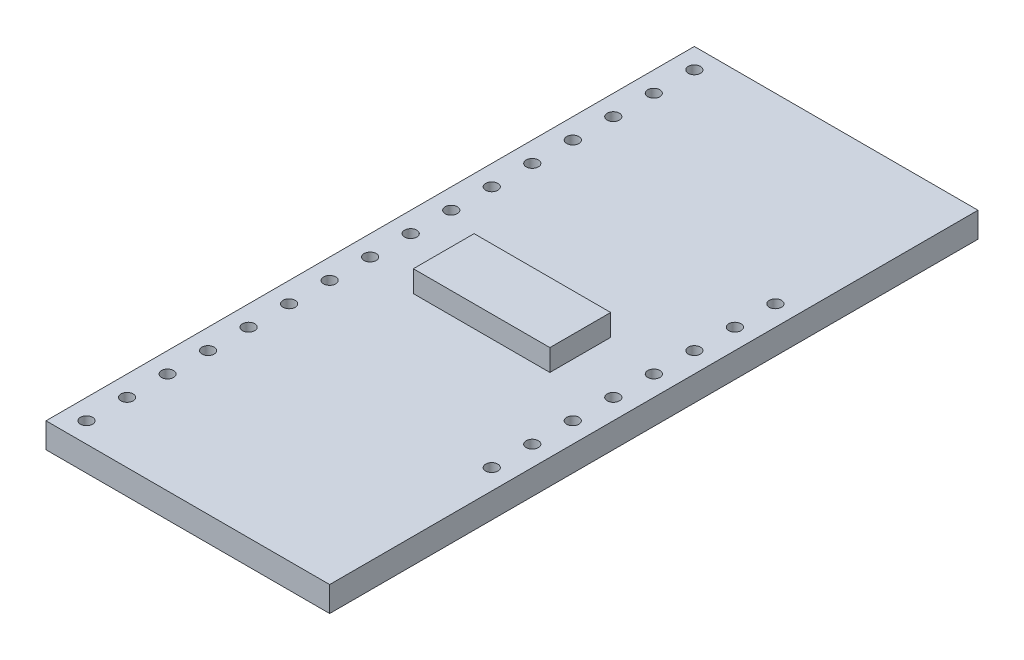
ISO-10303-21;
HEADER;
FILE_DESCRIPTION(('STEP AP214'),'2;1');
FILE_NAME('part.step','',(''),(''),'','','');
FILE_SCHEMA(('AUTOMOTIVE_DESIGN { 1 0 10303 214 1 1 1 1 }'));
ENDSEC;
DATA;
#1=APPLICATION_CONTEXT('core data for automotive mechanical design processes');
#2=APPLICATION_PROTOCOL_DEFINITION('international standard','automotive_design',2000,#1);
#3=PRODUCT_CONTEXT('',#1,'mechanical');
#4=PRODUCT('Part','Part','',(#3));
#5=PRODUCT_RELATED_PRODUCT_CATEGORY('part','',(#4));
#6=PRODUCT_DEFINITION_FORMATION('','',#4);
#7=PRODUCT_DEFINITION_CONTEXT('part definition',#1,'design');
#8=PRODUCT_DEFINITION('design','',#6,#7);
#9=PRODUCT_DEFINITION_SHAPE('','',#8);
#10=(LENGTH_UNIT() NAMED_UNIT(*) SI_UNIT(.MILLI.,.METRE.));
#11=(NAMED_UNIT(*) PLANE_ANGLE_UNIT() SI_UNIT($,.RADIAN.));
#12=(NAMED_UNIT(*) SI_UNIT($,.STERADIAN.) SOLID_ANGLE_UNIT());
#13=UNCERTAINTY_MEASURE_WITH_UNIT(LENGTH_MEASURE(1.E-05),#10,'distance_accuracy_value','');
#14=(GEOMETRIC_REPRESENTATION_CONTEXT(3) GLOBAL_UNCERTAINTY_ASSIGNED_CONTEXT((#13)) GLOBAL_UNIT_ASSIGNED_CONTEXT((#10,
#11,#12)) REPRESENTATION_CONTEXT('',''));
#15=CARTESIAN_POINT('',(0.,0.,0.));
#16=DIRECTION('',(0.,0.,1.));
#17=DIRECTION('',(1.,0.,0.));
#18=AXIS2_PLACEMENT_3D('',#15,#16,#17);
#19=CARTESIAN_POINT('',(0.,1.5748,0.));
#20=DIRECTION('',(0.,-1.,0.));
#21=DIRECTION('',(0.,0.,-1.));
#22=AXIS2_PLACEMENT_3D('',#19,#20,#21);
#23=PLANE('',#22);
#24=CARTESIAN_POINT('',(16.51,1.5748,-29.21));
#25=DIRECTION('',(0.,1.,0.));
#26=DIRECTION('',(0.,0.,1.));
#27=AXIS2_PLACEMENT_3D('',#24,#25,#26);
#28=CIRCLE('',#27,0.380999999999998);
#29=CARTESIAN_POINT('',(16.51,1.5748,-28.829));
#30=VERTEX_POINT('',#29);
#31=EDGE_CURVE('E11',#30,#30,#28,.T.);
#32=ORIENTED_EDGE('',*,*,#31,.F.);
#33=EDGE_LOOP('',(#32));
#34=FACE_BOUND('',#33,.T.);
#35=CARTESIAN_POINT('',(16.51,1.5748,-26.67));
#36=DIRECTION('',(0.,1.,0.));
#37=DIRECTION('',(0.,0.,1.));
#38=AXIS2_PLACEMENT_3D('',#35,#36,#37);
#39=CIRCLE('',#38,0.380999999999998);
#40=CARTESIAN_POINT('',(16.51,1.5748,-26.289));
#41=VERTEX_POINT('',#40);
#42=EDGE_CURVE('E293',#41,#41,#39,.T.);
#43=ORIENTED_EDGE('',*,*,#42,.F.);
#44=EDGE_LOOP('',(#43));
#45=FACE_BOUND('',#44,.T.);
#46=CARTESIAN_POINT('',(16.51,1.5748,-24.13));
#47=DIRECTION('',(0.,1.,0.));
#48=DIRECTION('',(0.,0.,1.));
#49=AXIS2_PLACEMENT_3D('',#46,#47,#48);
#50=CIRCLE('',#49,0.380999999999998);
#51=CARTESIAN_POINT('',(16.51,1.5748,-23.749));
#52=VERTEX_POINT('',#51);
#53=EDGE_CURVE('E287',#52,#52,#50,.T.);
#54=ORIENTED_EDGE('',*,*,#53,.F.);
#55=EDGE_LOOP('',(#54));
#56=FACE_BOUND('',#55,.T.);
#57=CARTESIAN_POINT('',(16.51,1.5748,-21.59));
#58=DIRECTION('',(0.,1.,0.));
#59=DIRECTION('',(0.,0.,1.));
#60=AXIS2_PLACEMENT_3D('',#57,#58,#59);
#61=CIRCLE('',#60,0.380999999999998);
#62=CARTESIAN_POINT('',(16.51,1.5748,-21.209));
#63=VERTEX_POINT('',#62);
#64=EDGE_CURVE('E281',#63,#63,#61,.T.);
#65=ORIENTED_EDGE('',*,*,#64,.F.);
#66=EDGE_LOOP('',(#65));
#67=FACE_BOUND('',#66,.T.);
#68=CARTESIAN_POINT('',(16.51,1.5748,-19.05));
#69=DIRECTION('',(0.,1.,0.));
#70=DIRECTION('',(0.,0.,1.));
#71=AXIS2_PLACEMENT_3D('',#68,#69,#70);
#72=CIRCLE('',#71,0.380999999999998);
#73=CARTESIAN_POINT('',(16.51,1.5748,-18.669));
#74=VERTEX_POINT('',#73);
#75=EDGE_CURVE('E275',#74,#74,#72,.T.);
#76=ORIENTED_EDGE('',*,*,#75,.F.);
#77=EDGE_LOOP('',(#76));
#78=FACE_BOUND('',#77,.T.);
#79=CARTESIAN_POINT('',(16.51,1.5748,-16.51));
#80=DIRECTION('',(0.,1.,0.));
#81=DIRECTION('',(0.,0.,1.));
#82=AXIS2_PLACEMENT_3D('',#79,#80,#81);
#83=CIRCLE('',#82,0.380999999999998);
#84=CARTESIAN_POINT('',(16.51,1.5748,-16.129));
#85=VERTEX_POINT('',#84);
#86=EDGE_CURVE('E269',#85,#85,#83,.T.);
#87=ORIENTED_EDGE('',*,*,#86,.F.);
#88=EDGE_LOOP('',(#87));
#89=FACE_BOUND('',#88,.T.);
#90=CARTESIAN_POINT('',(1.27,1.5748,-39.37));
#91=DIRECTION('',(0.,1.,0.));
#92=DIRECTION('',(0.,0.,1.));
#93=AXIS2_PLACEMENT_3D('',#90,#91,#92);
#94=CIRCLE('',#93,0.381);
#95=CARTESIAN_POINT('',(1.27,1.5748,-38.989));
#96=VERTEX_POINT('',#95);
#97=EDGE_CURVE('E263',#96,#96,#94,.T.);
#98=ORIENTED_EDGE('',*,*,#97,.F.);
#99=EDGE_LOOP('',(#98));
#100=FACE_BOUND('',#99,.T.);
#101=CARTESIAN_POINT('',(1.27,1.5748,-36.83));
#102=DIRECTION('',(0.,1.,0.));
#103=DIRECTION('',(0.,0.,1.));
#104=AXIS2_PLACEMENT_3D('',#101,#102,#103);
#105=CIRCLE('',#104,0.381);
#106=CARTESIAN_POINT('',(1.27,1.5748,-36.449));
#107=VERTEX_POINT('',#106);
#108=EDGE_CURVE('E257',#107,#107,#105,.T.);
#109=ORIENTED_EDGE('',*,*,#108,.F.);
#110=EDGE_LOOP('',(#109));
#111=FACE_BOUND('',#110,.T.);
#112=CARTESIAN_POINT('',(1.27,1.5748,-34.29));
#113=DIRECTION('',(0.,1.,0.));
#114=DIRECTION('',(0.,0.,1.));
#115=AXIS2_PLACEMENT_3D('',#112,#113,#114);
#116=CIRCLE('',#115,0.381);
#117=CARTESIAN_POINT('',(1.27,1.5748,-33.909));
#118=VERTEX_POINT('',#117);
#119=EDGE_CURVE('E251',#118,#118,#116,.T.);
#120=ORIENTED_EDGE('',*,*,#119,.F.);
#121=EDGE_LOOP('',(#120));
#122=FACE_BOUND('',#121,.T.);
#123=CARTESIAN_POINT('',(1.27,1.5748,-31.75));
#124=DIRECTION('',(0.,1.,0.));
#125=DIRECTION('',(0.,0.,1.));
#126=AXIS2_PLACEMENT_3D('',#123,#124,#125);
#127=CIRCLE('',#126,0.381);
#128=CARTESIAN_POINT('',(1.27,1.5748,-31.369));
#129=VERTEX_POINT('',#128);
#130=EDGE_CURVE('E245',#129,#129,#127,.T.);
#131=ORIENTED_EDGE('',*,*,#130,.F.);
#132=EDGE_LOOP('',(#131));
#133=FACE_BOUND('',#132,.T.);
#134=CARTESIAN_POINT('',(1.27,1.5748,-29.21));
#135=DIRECTION('',(0.,1.,0.));
#136=DIRECTION('',(0.,0.,1.));
#137=AXIS2_PLACEMENT_3D('',#134,#135,#136);
#138=CIRCLE('',#137,0.381);
#139=CARTESIAN_POINT('',(1.27,1.5748,-28.829));
#140=VERTEX_POINT('',#139);
#141=EDGE_CURVE('E239',#140,#140,#138,.T.);
#142=ORIENTED_EDGE('',*,*,#141,.F.);
#143=EDGE_LOOP('',(#142));
#144=FACE_BOUND('',#143,.T.);
#145=CARTESIAN_POINT('',(1.27,1.5748,-26.67));
#146=DIRECTION('',(0.,1.,0.));
#147=DIRECTION('',(0.,0.,1.));
#148=AXIS2_PLACEMENT_3D('',#145,#146,#147);
#149=CIRCLE('',#148,0.381);
#150=CARTESIAN_POINT('',(1.27,1.5748,-26.289));
#151=VERTEX_POINT('',#150);
#152=EDGE_CURVE('E233',#151,#151,#149,.T.);
#153=ORIENTED_EDGE('',*,*,#152,.F.);
#154=EDGE_LOOP('',(#153));
#155=FACE_BOUND('',#154,.T.);
#156=CARTESIAN_POINT('',(1.27,1.5748,-24.13));
#157=DIRECTION('',(0.,1.,0.));
#158=DIRECTION('',(0.,0.,1.));
#159=AXIS2_PLACEMENT_3D('',#156,#157,#158);
#160=CIRCLE('',#159,0.381);
#161=CARTESIAN_POINT('',(1.27,1.5748,-23.749));
#162=VERTEX_POINT('',#161);
#163=EDGE_CURVE('E227',#162,#162,#160,.T.);
#164=ORIENTED_EDGE('',*,*,#163,.F.);
#165=EDGE_LOOP('',(#164));
#166=FACE_BOUND('',#165,.T.);
#167=CARTESIAN_POINT('',(1.27,1.5748,-21.59));
#168=DIRECTION('',(0.,1.,0.));
#169=DIRECTION('',(0.,0.,1.));
#170=AXIS2_PLACEMENT_3D('',#167,#168,#169);
#171=CIRCLE('',#170,0.381);
#172=CARTESIAN_POINT('',(1.27,1.5748,-21.209));
#173=VERTEX_POINT('',#172);
#174=EDGE_CURVE('E221',#173,#173,#171,.T.);
#175=ORIENTED_EDGE('',*,*,#174,.F.);
#176=EDGE_LOOP('',(#175));
#177=FACE_BOUND('',#176,.T.);
#178=CARTESIAN_POINT('',(1.27,1.5748,-19.05));
#179=DIRECTION('',(0.,1.,0.));
#180=DIRECTION('',(0.,0.,1.));
#181=AXIS2_PLACEMENT_3D('',#178,#179,#180);
#182=CIRCLE('',#181,0.381);
#183=CARTESIAN_POINT('',(1.27,1.5748,-18.669));
#184=VERTEX_POINT('',#183);
#185=EDGE_CURVE('E215',#184,#184,#182,.T.);
#186=ORIENTED_EDGE('',*,*,#185,.F.);
#187=EDGE_LOOP('',(#186));
#188=FACE_BOUND('',#187,.T.);
#189=CARTESIAN_POINT('',(1.27,1.5748,-16.51));
#190=DIRECTION('',(0.,1.,0.));
#191=DIRECTION('',(0.,0.,1.));
#192=AXIS2_PLACEMENT_3D('',#189,#190,#191);
#193=CIRCLE('',#192,0.381);
#194=CARTESIAN_POINT('',(1.27,1.5748,-16.129));
#195=VERTEX_POINT('',#194);
#196=EDGE_CURVE('E209',#195,#195,#193,.T.);
#197=ORIENTED_EDGE('',*,*,#196,.F.);
#198=EDGE_LOOP('',(#197));
#199=FACE_BOUND('',#198,.T.);
#200=CARTESIAN_POINT('',(1.27,1.5748,-13.97));
#201=DIRECTION('',(0.,1.,0.));
#202=DIRECTION('',(0.,0.,1.));
#203=AXIS2_PLACEMENT_3D('',#200,#201,#202);
#204=CIRCLE('',#203,0.381);
#205=CARTESIAN_POINT('',(1.27,1.5748,-13.589));
#206=VERTEX_POINT('',#205);
#207=EDGE_CURVE('E203',#206,#206,#204,.T.);
#208=ORIENTED_EDGE('',*,*,#207,.F.);
#209=EDGE_LOOP('',(#208));
#210=FACE_BOUND('',#209,.T.);
#211=CARTESIAN_POINT('',(1.27,1.5748,-11.43));
#212=DIRECTION('',(0.,1.,0.));
#213=DIRECTION('',(0.,0.,1.));
#214=AXIS2_PLACEMENT_3D('',#211,#212,#213);
#215=CIRCLE('',#214,0.381);
#216=CARTESIAN_POINT('',(1.27,1.5748,-11.049));
#217=VERTEX_POINT('',#216);
#218=EDGE_CURVE('E197',#217,#217,#215,.T.);
#219=ORIENTED_EDGE('',*,*,#218,.F.);
#220=EDGE_LOOP('',(#219));
#221=FACE_BOUND('',#220,.T.);
#222=CARTESIAN_POINT('',(1.27,1.5748,-8.89));
#223=DIRECTION('',(0.,1.,0.));
#224=DIRECTION('',(0.,0.,1.));
#225=AXIS2_PLACEMENT_3D('',#222,#223,#224);
#226=CIRCLE('',#225,0.381);
#227=CARTESIAN_POINT('',(1.27,1.5748,-8.509));
#228=VERTEX_POINT('',#227);
#229=EDGE_CURVE('E191',#228,#228,#226,.T.);
#230=ORIENTED_EDGE('',*,*,#229,.F.);
#231=EDGE_LOOP('',(#230));
#232=FACE_BOUND('',#231,.T.);
#233=CARTESIAN_POINT('',(1.27,1.5748,-6.35));
#234=DIRECTION('',(0.,1.,0.));
#235=DIRECTION('',(0.,0.,1.));
#236=AXIS2_PLACEMENT_3D('',#233,#234,#235);
#237=CIRCLE('',#236,0.381);
#238=CARTESIAN_POINT('',(1.27,1.5748,-5.969));
#239=VERTEX_POINT('',#238);
#240=EDGE_CURVE('E185',#239,#239,#237,.T.);
#241=ORIENTED_EDGE('',*,*,#240,.F.);
#242=EDGE_LOOP('',(#241));
#243=FACE_BOUND('',#242,.T.);
#244=DIRECTION('',(0.,0.,1.));
#245=VECTOR('',#244,1.);
#246=CARTESIAN_POINT('',(0.,1.5748,0.));
#247=LINE('',#246,#245);
#248=CARTESIAN_POINT('',(0.,1.5748,-40.64));
#249=VERTEX_POINT('',#248);
#250=CARTESIAN_POINT('',(0.,1.5748,0.));
#251=VERTEX_POINT('',#250);
#252=EDGE_CURVE('E153',#249,#251,#247,.T.);
#253=ORIENTED_EDGE('',*,*,#252,.T.);
#254=DIRECTION('',(1.,0.,0.));
#255=VECTOR('',#254,1.);
#256=CARTESIAN_POINT('',(0.,1.5748,0.));
#257=LINE('',#256,#255);
#258=CARTESIAN_POINT('',(17.78,1.5748,0.));
#259=VERTEX_POINT('',#258);
#260=EDGE_CURVE('E156',#251,#259,#257,.T.);
#261=ORIENTED_EDGE('',*,*,#260,.T.);
#262=DIRECTION('',(0.,0.,-1.));
#263=VECTOR('',#262,1.);
#264=CARTESIAN_POINT('',(17.78,1.5748,0.));
#265=LINE('',#264,#263);
#266=CARTESIAN_POINT('',(17.78,1.5748,-40.64));
#267=VERTEX_POINT('',#266);
#268=EDGE_CURVE('E159',#259,#267,#265,.T.);
#269=ORIENTED_EDGE('',*,*,#268,.T.);
#270=DIRECTION('',(-1.,0.,0.));
#271=VECTOR('',#270,1.);
#272=CARTESIAN_POINT('',(0.,1.5748,-40.64));
#273=LINE('',#272,#271);
#274=EDGE_CURVE('E161',#267,#249,#273,.T.);
#275=ORIENTED_EDGE('',*,*,#274,.T.);
#276=EDGE_LOOP('',(#253,#261,#269,#275));
#277=FACE_BOUND('',#276,.T.);
#278=CARTESIAN_POINT('',(1.27,1.5748,-1.27));
#279=DIRECTION('',(0.,1.,0.));
#280=DIRECTION('',(0.,0.,1.));
#281=AXIS2_PLACEMENT_3D('',#278,#279,#280);
#282=CIRCLE('',#281,0.381);
#283=CARTESIAN_POINT('',(1.27,1.5748,-0.889));
#284=VERTEX_POINT('',#283);
#285=EDGE_CURVE('E146',#284,#284,#282,.T.);
#286=ORIENTED_EDGE('',*,*,#285,.F.);
#287=EDGE_LOOP('',(#286));
#288=FACE_BOUND('',#287,.T.);
#289=CARTESIAN_POINT('',(1.27,1.5748,-3.81));
#290=DIRECTION('',(0.,1.,0.));
#291=DIRECTION('',(0.,0.,1.));
#292=AXIS2_PLACEMENT_3D('',#289,#290,#291);
#293=CIRCLE('',#292,0.381);
#294=CARTESIAN_POINT('',(1.27,1.5748,-3.429));
#295=VERTEX_POINT('',#294);
#296=EDGE_CURVE('E143',#295,#295,#293,.T.);
#297=ORIENTED_EDGE('',*,*,#296,.F.);
#298=EDGE_LOOP('',(#297));
#299=FACE_BOUND('',#298,.T.);
#300=CARTESIAN_POINT('',(16.51,1.5748,-11.43));
#301=DIRECTION('',(0.,1.,0.));
#302=DIRECTION('',(0.,0.,1.));
#303=AXIS2_PLACEMENT_3D('',#300,#301,#302);
#304=CIRCLE('',#303,0.380999999999998);
#305=CARTESIAN_POINT('',(16.51,1.5748,-11.049));
#306=VERTEX_POINT('',#305);
#307=EDGE_CURVE('E134',#306,#306,#304,.T.);
#308=ORIENTED_EDGE('',*,*,#307,.F.);
#309=EDGE_LOOP('',(#308));
#310=FACE_BOUND('',#309,.T.);
#311=CARTESIAN_POINT('',(16.51,1.5748,-13.97));
#312=DIRECTION('',(0.,1.,0.));
#313=DIRECTION('',(0.,0.,1.));
#314=AXIS2_PLACEMENT_3D('',#311,#312,#313);
#315=CIRCLE('',#314,0.380999999999998);
#316=CARTESIAN_POINT('',(16.51,1.5748,-13.589));
#317=VERTEX_POINT('',#316);
#318=EDGE_CURVE('E126',#317,#317,#315,.T.);
#319=ORIENTED_EDGE('',*,*,#318,.F.);
#320=EDGE_LOOP('',(#319));
#321=FACE_BOUND('',#320,.T.);
#322=DIRECTION('',(0.,0.,-1.));
#323=VECTOR('',#322,1.);
#324=CARTESIAN_POINT('',(13.1699,1.5748,-18.415));
#325=LINE('',#324,#323);
#326=CARTESIAN_POINT('',(13.1699,1.5748,-18.415));
#327=VERTEX_POINT('',#326);
#328=CARTESIAN_POINT('',(13.1699,1.5748,-22.225));
#329=VERTEX_POINT('',#328);
#330=EDGE_CURVE('E122',#327,#329,#325,.T.);
#331=ORIENTED_EDGE('',*,*,#330,.F.);
#332=DIRECTION('',(1.,0.,0.));
#333=VECTOR('',#332,1.);
#334=CARTESIAN_POINT('',(4.6101,1.5748,-18.415));
#335=LINE('',#334,#333);
#336=CARTESIAN_POINT('',(4.6101,1.5748,-18.415));
#337=VERTEX_POINT('',#336);
#338=EDGE_CURVE('E119',#337,#327,#335,.T.);
#339=ORIENTED_EDGE('',*,*,#338,.F.);
#340=DIRECTION('',(0.,0.,1.));
#341=VECTOR('',#340,1.);
#342=CARTESIAN_POINT('',(4.6101,1.5748,-18.415));
#343=LINE('',#342,#341);
#344=CARTESIAN_POINT('',(4.6101,1.5748,-22.225));
#345=VERTEX_POINT('',#344);
#346=EDGE_CURVE('E57',#345,#337,#343,.T.);
#347=ORIENTED_EDGE('',*,*,#346,.F.);
#348=DIRECTION('',(-1.,0.,0.));
#349=VECTOR('',#348,1.);
#350=CARTESIAN_POINT('',(4.6101,1.5748,-22.225));
#351=LINE('',#350,#349);
#352=EDGE_CURVE('E52',#329,#345,#351,.T.);
#353=ORIENTED_EDGE('',*,*,#352,.F.);
#354=EDGE_LOOP('',(#331,#339,#347,#353));
#355=FACE_BOUND('',#354,.T.);
#356=ADVANCED_FACE('F37',(#34,#45,#56,#67,#78,#89,#100,#111,#122,#133,#144,#155,#166,#177,#188,
#199,#210,#221,#232,#243,#277,#288,#299,#310,#321,#355),#23,.F.);
#357=CARTESIAN_POINT('',(0.,1.5748,0.));
#358=DIRECTION('',(1.,0.,0.));
#359=DIRECTION('',(0.,0.,-1.));
#360=AXIS2_PLACEMENT_3D('',#357,#358,#359);
#361=PLANE('',#360);
#362=DIRECTION('',(0.,0.,1.));
#363=VECTOR('',#362,1.);
#364=CARTESIAN_POINT('',(0.,0.,0.));
#365=LINE('',#364,#363);
#366=CARTESIAN_POINT('',(0.,0.,-40.64));
#367=VERTEX_POINT('',#366);
#368=CARTESIAN_POINT('',(0.,0.,0.));
#369=VERTEX_POINT('',#368);
#370=EDGE_CURVE('E150',#367,#369,#365,.T.);
#371=ORIENTED_EDGE('',*,*,#370,.T.);
#372=DIRECTION('',(0.,-1.,0.));
#373=VECTOR('',#372,1.);
#374=CARTESIAN_POINT('',(0.,1.5748,0.));
#375=LINE('',#374,#373);
#376=EDGE_CURVE('E179',#251,#369,#375,.T.);
#377=ORIENTED_EDGE('',*,*,#376,.F.);
#378=ORIENTED_EDGE('',*,*,#252,.F.);
#379=DIRECTION('',(0.,-1.,0.));
#380=VECTOR('',#379,1.);
#381=CARTESIAN_POINT('',(0.,1.5748,-40.64));
#382=LINE('',#381,#380);
#383=EDGE_CURVE('E163',#249,#367,#382,.T.);
#384=ORIENTED_EDGE('',*,*,#383,.T.);
#385=EDGE_LOOP('',(#371,#377,#378,#384));
#386=FACE_BOUND('',#385,.T.);
#387=ADVANCED_FACE('F307',(#386),#361,.F.);
#388=CARTESIAN_POINT('',(0.,1.5748,0.));
#389=DIRECTION('',(0.,0.,-1.));
#390=DIRECTION('',(-1.,0.,0.));
#391=AXIS2_PLACEMENT_3D('',#388,#389,#390);
#392=PLANE('',#391);
#393=DIRECTION('',(1.,0.,0.));
#394=VECTOR('',#393,1.);
#395=CARTESIAN_POINT('',(0.,0.,0.));
#396=LINE('',#395,#394);
#397=CARTESIAN_POINT('',(17.78,0.,0.));
#398=VERTEX_POINT('',#397);
#399=EDGE_CURVE('E166',#369,#398,#396,.T.);
#400=ORIENTED_EDGE('',*,*,#399,.T.);
#401=DIRECTION('',(0.,-1.,0.));
#402=VECTOR('',#401,1.);
#403=CARTESIAN_POINT('',(17.78,1.5748,0.));
#404=LINE('',#403,#402);
#405=EDGE_CURVE('E176',#259,#398,#404,.T.);
#406=ORIENTED_EDGE('',*,*,#405,.F.);
#407=ORIENTED_EDGE('',*,*,#260,.F.);
#408=ORIENTED_EDGE('',*,*,#376,.T.);
#409=EDGE_LOOP('',(#400,#406,#407,#408));
#410=FACE_BOUND('',#409,.T.);
#411=ADVANCED_FACE('F413',(#410),#392,.F.);
#412=CARTESIAN_POINT('',(17.78,1.5748,0.));
#413=DIRECTION('',(-1.,0.,0.));
#414=DIRECTION('',(0.,0.,1.));
#415=AXIS2_PLACEMENT_3D('',#412,#413,#414);
#416=PLANE('',#415);
#417=DIRECTION('',(0.,0.,-1.));
#418=VECTOR('',#417,1.);
#419=CARTESIAN_POINT('',(17.78,0.,0.));
#420=LINE('',#419,#418);
#421=CARTESIAN_POINT('',(17.78,0.,-40.64));
#422=VERTEX_POINT('',#421);
#423=EDGE_CURVE('E168',#398,#422,#420,.T.);
#424=ORIENTED_EDGE('',*,*,#423,.T.);
#425=DIRECTION('',(0.,-1.,0.));
#426=VECTOR('',#425,1.);
#427=CARTESIAN_POINT('',(17.78,1.5748,-40.64));
#428=LINE('',#427,#426);
#429=EDGE_CURVE('E173',#267,#422,#428,.T.);
#430=ORIENTED_EDGE('',*,*,#429,.F.);
#431=ORIENTED_EDGE('',*,*,#268,.F.);
#432=ORIENTED_EDGE('',*,*,#405,.T.);
#433=EDGE_LOOP('',(#424,#430,#431,#432));
#434=FACE_BOUND('',#433,.T.);
#435=ADVANCED_FACE('F409',(#434),#416,.F.);
#436=CARTESIAN_POINT('',(0.,1.5748,-40.64));
#437=DIRECTION('',(0.,0.,1.));
#438=DIRECTION('',(1.,0.,0.));
#439=AXIS2_PLACEMENT_3D('',#436,#437,#438);
#440=PLANE('',#439);
#441=DIRECTION('',(-1.,0.,0.));
#442=VECTOR('',#441,1.);
#443=CARTESIAN_POINT('',(0.,0.,-40.64));
#444=LINE('',#443,#442);
#445=EDGE_CURVE('E157',#422,#367,#444,.T.);
#446=ORIENTED_EDGE('',*,*,#445,.T.);
#447=ORIENTED_EDGE('',*,*,#383,.F.);
#448=ORIENTED_EDGE('',*,*,#274,.F.);
#449=ORIENTED_EDGE('',*,*,#429,.T.);
#450=EDGE_LOOP('',(#446,#447,#448,#449));
#451=FACE_BOUND('',#450,.T.);
#452=ADVANCED_FACE('F405',(#451),#440,.F.);
#453=CARTESIAN_POINT('',(0.,0.,0.));
#454=DIRECTION('',(0.,-1.,0.));
#455=DIRECTION('',(0.,0.,-1.));
#456=AXIS2_PLACEMENT_3D('',#453,#454,#455);
#457=PLANE('',#456);
#458=CARTESIAN_POINT('',(16.51,0.,-13.97));
#459=DIRECTION('',(0.,1.,0.));
#460=DIRECTION('',(0.,0.,1.));
#461=AXIS2_PLACEMENT_3D('',#458,#459,#460);
#462=CIRCLE('',#461,0.380999999999998);
#463=CARTESIAN_POINT('',(16.51,0.,-13.589));
#464=VERTEX_POINT('',#463);
#465=EDGE_CURVE('E123',#464,#464,#462,.T.);
#466=ORIENTED_EDGE('',*,*,#465,.T.);
#467=EDGE_LOOP('',(#466));
#468=FACE_BOUND('',#467,.T.);
#469=CARTESIAN_POINT('',(16.51,0.,-11.43));
#470=DIRECTION('',(0.,1.,0.));
#471=DIRECTION('',(0.,0.,1.));
#472=AXIS2_PLACEMENT_3D('',#469,#470,#471);
#473=CIRCLE('',#472,0.380999999999998);
#474=CARTESIAN_POINT('',(16.51,0.,-11.049));
#475=VERTEX_POINT('',#474);
#476=EDGE_CURVE('E135',#475,#475,#473,.T.);
#477=ORIENTED_EDGE('',*,*,#476,.T.);
#478=EDGE_LOOP('',(#477));
#479=FACE_BOUND('',#478,.T.);
#480=CARTESIAN_POINT('',(1.27,0.,-3.81));
#481=DIRECTION('',(0.,1.,0.));
#482=DIRECTION('',(0.,0.,1.));
#483=AXIS2_PLACEMENT_3D('',#480,#481,#482);
#484=CIRCLE('',#483,0.381);
#485=CARTESIAN_POINT('',(1.27,0.,-3.429));
#486=VERTEX_POINT('',#485);
#487=EDGE_CURVE('E138',#486,#486,#484,.T.);
#488=ORIENTED_EDGE('',*,*,#487,.T.);
#489=EDGE_LOOP('',(#488));
#490=FACE_BOUND('',#489,.T.);
#491=CARTESIAN_POINT('',(1.27,0.,-1.27));
#492=DIRECTION('',(0.,1.,0.));
#493=DIRECTION('',(0.,0.,1.));
#494=AXIS2_PLACEMENT_3D('',#491,#492,#493);
#495=CIRCLE('',#494,0.381);
#496=CARTESIAN_POINT('',(1.27,0.,-0.889));
#497=VERTEX_POINT('',#496);
#498=EDGE_CURVE('E147',#497,#497,#495,.T.);
#499=ORIENTED_EDGE('',*,*,#498,.T.);
#500=EDGE_LOOP('',(#499));
#501=FACE_BOUND('',#500,.T.);
#502=ORIENTED_EDGE('',*,*,#370,.F.);
#503=ORIENTED_EDGE('',*,*,#445,.F.);
#504=ORIENTED_EDGE('',*,*,#423,.F.);
#505=ORIENTED_EDGE('',*,*,#399,.F.);
#506=EDGE_LOOP('',(#502,#503,#504,#505));
#507=FACE_BOUND('',#506,.T.);
#508=CARTESIAN_POINT('',(1.27,0.,-6.35));
#509=DIRECTION('',(0.,1.,0.));
#510=DIRECTION('',(0.,0.,1.));
#511=AXIS2_PLACEMENT_3D('',#508,#509,#510);
#512=CIRCLE('',#511,0.381);
#513=CARTESIAN_POINT('',(1.27,0.,-5.969));
#514=VERTEX_POINT('',#513);
#515=EDGE_CURVE('E182',#514,#514,#512,.T.);
#516=ORIENTED_EDGE('',*,*,#515,.T.);
#517=EDGE_LOOP('',(#516));
#518=FACE_BOUND('',#517,.T.);
#519=CARTESIAN_POINT('',(1.27,0.,-8.89));
#520=DIRECTION('',(0.,1.,0.));
#521=DIRECTION('',(0.,0.,1.));
#522=AXIS2_PLACEMENT_3D('',#519,#520,#521);
#523=CIRCLE('',#522,0.381);
#524=CARTESIAN_POINT('',(1.27,0.,-8.509));
#525=VERTEX_POINT('',#524);
#526=EDGE_CURVE('E188',#525,#525,#523,.T.);
#527=ORIENTED_EDGE('',*,*,#526,.T.);
#528=EDGE_LOOP('',(#527));
#529=FACE_BOUND('',#528,.T.);
#530=CARTESIAN_POINT('',(1.27,0.,-11.43));
#531=DIRECTION('',(0.,1.,0.));
#532=DIRECTION('',(0.,0.,1.));
#533=AXIS2_PLACEMENT_3D('',#530,#531,#532);
#534=CIRCLE('',#533,0.381);
#535=CARTESIAN_POINT('',(1.27,0.,-11.049));
#536=VERTEX_POINT('',#535);
#537=EDGE_CURVE('E194',#536,#536,#534,.T.);
#538=ORIENTED_EDGE('',*,*,#537,.T.);
#539=EDGE_LOOP('',(#538));
#540=FACE_BOUND('',#539,.T.);
#541=CARTESIAN_POINT('',(1.27,0.,-13.97));
#542=DIRECTION('',(0.,1.,0.));
#543=DIRECTION('',(0.,0.,1.));
#544=AXIS2_PLACEMENT_3D('',#541,#542,#543);
#545=CIRCLE('',#544,0.381);
#546=CARTESIAN_POINT('',(1.27,0.,-13.589));
#547=VERTEX_POINT('',#546);
#548=EDGE_CURVE('E200',#547,#547,#545,.T.);
#549=ORIENTED_EDGE('',*,*,#548,.T.);
#550=EDGE_LOOP('',(#549));
#551=FACE_BOUND('',#550,.T.);
#552=CARTESIAN_POINT('',(1.27,0.,-16.51));
#553=DIRECTION('',(0.,1.,0.));
#554=DIRECTION('',(0.,0.,1.));
#555=AXIS2_PLACEMENT_3D('',#552,#553,#554);
#556=CIRCLE('',#555,0.381);
#557=CARTESIAN_POINT('',(1.27,0.,-16.129));
#558=VERTEX_POINT('',#557);
#559=EDGE_CURVE('E206',#558,#558,#556,.T.);
#560=ORIENTED_EDGE('',*,*,#559,.T.);
#561=EDGE_LOOP('',(#560));
#562=FACE_BOUND('',#561,.T.);
#563=CARTESIAN_POINT('',(1.27,0.,-19.05));
#564=DIRECTION('',(0.,1.,0.));
#565=DIRECTION('',(0.,0.,1.));
#566=AXIS2_PLACEMENT_3D('',#563,#564,#565);
#567=CIRCLE('',#566,0.381);
#568=CARTESIAN_POINT('',(1.27,0.,-18.669));
#569=VERTEX_POINT('',#568);
#570=EDGE_CURVE('E212',#569,#569,#567,.T.);
#571=ORIENTED_EDGE('',*,*,#570,.T.);
#572=EDGE_LOOP('',(#571));
#573=FACE_BOUND('',#572,.T.);
#574=CARTESIAN_POINT('',(1.27,0.,-21.59));
#575=DIRECTION('',(0.,1.,0.));
#576=DIRECTION('',(0.,0.,1.));
#577=AXIS2_PLACEMENT_3D('',#574,#575,#576);
#578=CIRCLE('',#577,0.381);
#579=CARTESIAN_POINT('',(1.27,0.,-21.209));
#580=VERTEX_POINT('',#579);
#581=EDGE_CURVE('E218',#580,#580,#578,.T.);
#582=ORIENTED_EDGE('',*,*,#581,.T.);
#583=EDGE_LOOP('',(#582));
#584=FACE_BOUND('',#583,.T.);
#585=CARTESIAN_POINT('',(1.27,0.,-24.13));
#586=DIRECTION('',(0.,1.,0.));
#587=DIRECTION('',(0.,0.,1.));
#588=AXIS2_PLACEMENT_3D('',#585,#586,#587);
#589=CIRCLE('',#588,0.381);
#590=CARTESIAN_POINT('',(1.27,0.,-23.749));
#591=VERTEX_POINT('',#590);
#592=EDGE_CURVE('E224',#591,#591,#589,.T.);
#593=ORIENTED_EDGE('',*,*,#592,.T.);
#594=EDGE_LOOP('',(#593));
#595=FACE_BOUND('',#594,.T.);
#596=CARTESIAN_POINT('',(1.27,0.,-26.67));
#597=DIRECTION('',(0.,1.,0.));
#598=DIRECTION('',(0.,0.,1.));
#599=AXIS2_PLACEMENT_3D('',#596,#597,#598);
#600=CIRCLE('',#599,0.381);
#601=CARTESIAN_POINT('',(1.27,0.,-26.289));
#602=VERTEX_POINT('',#601);
#603=EDGE_CURVE('E230',#602,#602,#600,.T.);
#604=ORIENTED_EDGE('',*,*,#603,.T.);
#605=EDGE_LOOP('',(#604));
#606=FACE_BOUND('',#605,.T.);
#607=CARTESIAN_POINT('',(1.27,0.,-29.21));
#608=DIRECTION('',(0.,1.,0.));
#609=DIRECTION('',(0.,0.,1.));
#610=AXIS2_PLACEMENT_3D('',#607,#608,#609);
#611=CIRCLE('',#610,0.381);
#612=CARTESIAN_POINT('',(1.27,0.,-28.829));
#613=VERTEX_POINT('',#612);
#614=EDGE_CURVE('E236',#613,#613,#611,.T.);
#615=ORIENTED_EDGE('',*,*,#614,.T.);
#616=EDGE_LOOP('',(#615));
#617=FACE_BOUND('',#616,.T.);
#618=CARTESIAN_POINT('',(1.27,0.,-31.75));
#619=DIRECTION('',(0.,1.,0.));
#620=DIRECTION('',(0.,0.,1.));
#621=AXIS2_PLACEMENT_3D('',#618,#619,#620);
#622=CIRCLE('',#621,0.381);
#623=CARTESIAN_POINT('',(1.27,0.,-31.369));
#624=VERTEX_POINT('',#623);
#625=EDGE_CURVE('E242',#624,#624,#622,.T.);
#626=ORIENTED_EDGE('',*,*,#625,.T.);
#627=EDGE_LOOP('',(#626));
#628=FACE_BOUND('',#627,.T.);
#629=CARTESIAN_POINT('',(1.27,0.,-34.29));
#630=DIRECTION('',(0.,1.,0.));
#631=DIRECTION('',(0.,0.,1.));
#632=AXIS2_PLACEMENT_3D('',#629,#630,#631);
#633=CIRCLE('',#632,0.381);
#634=CARTESIAN_POINT('',(1.27,0.,-33.909));
#635=VERTEX_POINT('',#634);
#636=EDGE_CURVE('E248',#635,#635,#633,.T.);
#637=ORIENTED_EDGE('',*,*,#636,.T.);
#638=EDGE_LOOP('',(#637));
#639=FACE_BOUND('',#638,.T.);
#640=CARTESIAN_POINT('',(1.27,0.,-36.83));
#641=DIRECTION('',(0.,1.,0.));
#642=DIRECTION('',(0.,0.,1.));
#643=AXIS2_PLACEMENT_3D('',#640,#641,#642);
#644=CIRCLE('',#643,0.381);
#645=CARTESIAN_POINT('',(1.27,0.,-36.449));
#646=VERTEX_POINT('',#645);
#647=EDGE_CURVE('E254',#646,#646,#644,.T.);
#648=ORIENTED_EDGE('',*,*,#647,.T.);
#649=EDGE_LOOP('',(#648));
#650=FACE_BOUND('',#649,.T.);
#651=CARTESIAN_POINT('',(1.27,0.,-39.37));
#652=DIRECTION('',(0.,1.,0.));
#653=DIRECTION('',(0.,0.,1.));
#654=AXIS2_PLACEMENT_3D('',#651,#652,#653);
#655=CIRCLE('',#654,0.381);
#656=CARTESIAN_POINT('',(1.27,0.,-38.989));
#657=VERTEX_POINT('',#656);
#658=EDGE_CURVE('E260',#657,#657,#655,.T.);
#659=ORIENTED_EDGE('',*,*,#658,.T.);
#660=EDGE_LOOP('',(#659));
#661=FACE_BOUND('',#660,.T.);
#662=CARTESIAN_POINT('',(16.51,0.,-16.51));
#663=DIRECTION('',(0.,1.,0.));
#664=DIRECTION('',(0.,0.,1.));
#665=AXIS2_PLACEMENT_3D('',#662,#663,#664);
#666=CIRCLE('',#665,0.380999999999998);
#667=CARTESIAN_POINT('',(16.51,0.,-16.129));
#668=VERTEX_POINT('',#667);
#669=EDGE_CURVE('E266',#668,#668,#666,.T.);
#670=ORIENTED_EDGE('',*,*,#669,.T.);
#671=EDGE_LOOP('',(#670));
#672=FACE_BOUND('',#671,.T.);
#673=CARTESIAN_POINT('',(16.51,0.,-19.05));
#674=DIRECTION('',(0.,1.,0.));
#675=DIRECTION('',(0.,0.,1.));
#676=AXIS2_PLACEMENT_3D('',#673,#674,#675);
#677=CIRCLE('',#676,0.380999999999998);
#678=CARTESIAN_POINT('',(16.51,0.,-18.669));
#679=VERTEX_POINT('',#678);
#680=EDGE_CURVE('E272',#679,#679,#677,.T.);
#681=ORIENTED_EDGE('',*,*,#680,.T.);
#682=EDGE_LOOP('',(#681));
#683=FACE_BOUND('',#682,.T.);
#684=CARTESIAN_POINT('',(16.51,0.,-21.59));
#685=DIRECTION('',(0.,1.,0.));
#686=DIRECTION('',(0.,0.,1.));
#687=AXIS2_PLACEMENT_3D('',#684,#685,#686);
#688=CIRCLE('',#687,0.380999999999998);
#689=CARTESIAN_POINT('',(16.51,0.,-21.209));
#690=VERTEX_POINT('',#689);
#691=EDGE_CURVE('E278',#690,#690,#688,.T.);
#692=ORIENTED_EDGE('',*,*,#691,.T.);
#693=EDGE_LOOP('',(#692));
#694=FACE_BOUND('',#693,.T.);
#695=CARTESIAN_POINT('',(16.51,0.,-24.13));
#696=DIRECTION('',(0.,1.,0.));
#697=DIRECTION('',(0.,0.,1.));
#698=AXIS2_PLACEMENT_3D('',#695,#696,#697);
#699=CIRCLE('',#698,0.380999999999998);
#700=CARTESIAN_POINT('',(16.51,0.,-23.749));
#701=VERTEX_POINT('',#700);
#702=EDGE_CURVE('E284',#701,#701,#699,.T.);
#703=ORIENTED_EDGE('',*,*,#702,.T.);
#704=EDGE_LOOP('',(#703));
#705=FACE_BOUND('',#704,.T.);
#706=CARTESIAN_POINT('',(16.51,0.,-26.67));
#707=DIRECTION('',(0.,1.,0.));
#708=DIRECTION('',(0.,0.,1.));
#709=AXIS2_PLACEMENT_3D('',#706,#707,#708);
#710=CIRCLE('',#709,0.380999999999998);
#711=CARTESIAN_POINT('',(16.51,0.,-26.289));
#712=VERTEX_POINT('',#711);
#713=EDGE_CURVE('E290',#712,#712,#710,.T.);
#714=ORIENTED_EDGE('',*,*,#713,.T.);
#715=EDGE_LOOP('',(#714));
#716=FACE_BOUND('',#715,.T.);
#717=CARTESIAN_POINT('',(16.51,0.,-29.21));
#718=DIRECTION('',(0.,1.,0.));
#719=DIRECTION('',(0.,0.,1.));
#720=AXIS2_PLACEMENT_3D('',#717,#718,#719);
#721=CIRCLE('',#720,0.380999999999998);
#722=CARTESIAN_POINT('',(16.51,0.,-28.829));
#723=VERTEX_POINT('',#722);
#724=EDGE_CURVE('E45',#723,#723,#721,.T.);
#725=ORIENTED_EDGE('',*,*,#724,.T.);
#726=EDGE_LOOP('',(#725));
#727=FACE_BOUND('',#726,.T.);
#728=ADVANCED_FACE('F298',(#468,#479,#490,#501,#507,#518,#529,#540,#551,#562,#573,#584,#595,
#606,#617,#628,#639,#650,#661,#672,#683,#694,#705,#716,#727),#457,.T.);
#729=CARTESIAN_POINT('',(1.27,0.,-1.27));
#730=DIRECTION('',(0.,1.,0.));
#731=DIRECTION('',(0.,0.,1.));
#732=AXIS2_PLACEMENT_3D('',#729,#730,#731);
#733=CYLINDRICAL_SURFACE('',#732,0.381);
#734=ORIENTED_EDGE('',*,*,#498,.F.);
#735=EDGE_LOOP('',(#734));
#736=FACE_BOUND('',#735,.T.);
#737=ORIENTED_EDGE('',*,*,#285,.T.);
#738=EDGE_LOOP('',(#737));
#739=FACE_BOUND('',#738,.T.);
#740=ADVANCED_FACE('F398',(#736,#739),#733,.F.);
#741=CARTESIAN_POINT('',(1.27,0.,-3.81));
#742=DIRECTION('',(0.,1.,0.));
#743=DIRECTION('',(0.,0.,1.));
#744=AXIS2_PLACEMENT_3D('',#741,#742,#743);
#745=CYLINDRICAL_SURFACE('',#744,0.381);
#746=ORIENTED_EDGE('',*,*,#487,.F.);
#747=EDGE_LOOP('',(#746));
#748=FACE_BOUND('',#747,.T.);
#749=ORIENTED_EDGE('',*,*,#296,.T.);
#750=EDGE_LOOP('',(#749));
#751=FACE_BOUND('',#750,.T.);
#752=ADVANCED_FACE('F394',(#748,#751),#745,.F.);
#753=CARTESIAN_POINT('',(1.27,0.,-6.35));
#754=DIRECTION('',(0.,1.,0.));
#755=DIRECTION('',(0.,0.,1.));
#756=AXIS2_PLACEMENT_3D('',#753,#754,#755);
#757=CYLINDRICAL_SURFACE('',#756,0.381);
#758=ORIENTED_EDGE('',*,*,#515,.F.);
#759=EDGE_LOOP('',(#758));
#760=FACE_BOUND('',#759,.T.);
#761=ORIENTED_EDGE('',*,*,#240,.T.);
#762=EDGE_LOOP('',(#761));
#763=FACE_BOUND('',#762,.T.);
#764=ADVANCED_FACE('F397',(#760,#763),#757,.F.);
#765=CARTESIAN_POINT('',(1.27,0.,-8.89));
#766=DIRECTION('',(0.,1.,0.));
#767=DIRECTION('',(0.,0.,1.));
#768=AXIS2_PLACEMENT_3D('',#765,#766,#767);
#769=CYLINDRICAL_SURFACE('',#768,0.381);
#770=ORIENTED_EDGE('',*,*,#526,.F.);
#771=EDGE_LOOP('',(#770));
#772=FACE_BOUND('',#771,.T.);
#773=ORIENTED_EDGE('',*,*,#229,.T.);
#774=EDGE_LOOP('',(#773));
#775=FACE_BOUND('',#774,.T.);
#776=ADVANCED_FACE('F423',(#772,#775),#769,.F.);
#777=CARTESIAN_POINT('',(1.27,0.,-11.43));
#778=DIRECTION('',(0.,1.,0.));
#779=DIRECTION('',(0.,0.,1.));
#780=AXIS2_PLACEMENT_3D('',#777,#778,#779);
#781=CYLINDRICAL_SURFACE('',#780,0.381);
#782=ORIENTED_EDGE('',*,*,#537,.F.);
#783=EDGE_LOOP('',(#782));
#784=FACE_BOUND('',#783,.T.);
#785=ORIENTED_EDGE('',*,*,#218,.T.);
#786=EDGE_LOOP('',(#785));
#787=FACE_BOUND('',#786,.T.);
#788=ADVANCED_FACE('F427',(#784,#787),#781,.F.);
#789=CARTESIAN_POINT('',(1.27,0.,-13.97));
#790=DIRECTION('',(0.,1.,0.));
#791=DIRECTION('',(0.,0.,1.));
#792=AXIS2_PLACEMENT_3D('',#789,#790,#791);
#793=CYLINDRICAL_SURFACE('',#792,0.381);
#794=ORIENTED_EDGE('',*,*,#548,.F.);
#795=EDGE_LOOP('',(#794));
#796=FACE_BOUND('',#795,.T.);
#797=ORIENTED_EDGE('',*,*,#207,.T.);
#798=EDGE_LOOP('',(#797));
#799=FACE_BOUND('',#798,.T.);
#800=ADVANCED_FACE('F431',(#796,#799),#793,.F.);
#801=CARTESIAN_POINT('',(1.27,0.,-16.51));
#802=DIRECTION('',(0.,1.,0.));
#803=DIRECTION('',(0.,0.,1.));
#804=AXIS2_PLACEMENT_3D('',#801,#802,#803);
#805=CYLINDRICAL_SURFACE('',#804,0.381);
#806=ORIENTED_EDGE('',*,*,#559,.F.);
#807=EDGE_LOOP('',(#806));
#808=FACE_BOUND('',#807,.T.);
#809=ORIENTED_EDGE('',*,*,#196,.T.);
#810=EDGE_LOOP('',(#809));
#811=FACE_BOUND('',#810,.T.);
#812=ADVANCED_FACE('F435',(#808,#811),#805,.F.);
#813=CARTESIAN_POINT('',(1.27,0.,-19.05));
#814=DIRECTION('',(0.,1.,0.));
#815=DIRECTION('',(0.,0.,1.));
#816=AXIS2_PLACEMENT_3D('',#813,#814,#815);
#817=CYLINDRICAL_SURFACE('',#816,0.381);
#818=ORIENTED_EDGE('',*,*,#570,.F.);
#819=EDGE_LOOP('',(#818));
#820=FACE_BOUND('',#819,.T.);
#821=ORIENTED_EDGE('',*,*,#185,.T.);
#822=EDGE_LOOP('',(#821));
#823=FACE_BOUND('',#822,.T.);
#824=ADVANCED_FACE('F439',(#820,#823),#817,.F.);
#825=CARTESIAN_POINT('',(1.27,0.,-21.59));
#826=DIRECTION('',(0.,1.,0.));
#827=DIRECTION('',(0.,0.,1.));
#828=AXIS2_PLACEMENT_3D('',#825,#826,#827);
#829=CYLINDRICAL_SURFACE('',#828,0.381);
#830=ORIENTED_EDGE('',*,*,#581,.F.);
#831=EDGE_LOOP('',(#830));
#832=FACE_BOUND('',#831,.T.);
#833=ORIENTED_EDGE('',*,*,#174,.T.);
#834=EDGE_LOOP('',(#833));
#835=FACE_BOUND('',#834,.T.);
#836=ADVANCED_FACE('F443',(#832,#835),#829,.F.);
#837=CARTESIAN_POINT('',(1.27,0.,-24.13));
#838=DIRECTION('',(0.,1.,0.));
#839=DIRECTION('',(0.,0.,1.));
#840=AXIS2_PLACEMENT_3D('',#837,#838,#839);
#841=CYLINDRICAL_SURFACE('',#840,0.381);
#842=ORIENTED_EDGE('',*,*,#592,.F.);
#843=EDGE_LOOP('',(#842));
#844=FACE_BOUND('',#843,.T.);
#845=ORIENTED_EDGE('',*,*,#163,.T.);
#846=EDGE_LOOP('',(#845));
#847=FACE_BOUND('',#846,.T.);
#848=ADVANCED_FACE('F447',(#844,#847),#841,.F.);
#849=CARTESIAN_POINT('',(1.27,0.,-26.67));
#850=DIRECTION('',(0.,1.,0.));
#851=DIRECTION('',(0.,0.,1.));
#852=AXIS2_PLACEMENT_3D('',#849,#850,#851);
#853=CYLINDRICAL_SURFACE('',#852,0.381);
#854=ORIENTED_EDGE('',*,*,#603,.F.);
#855=EDGE_LOOP('',(#854));
#856=FACE_BOUND('',#855,.T.);
#857=ORIENTED_EDGE('',*,*,#152,.T.);
#858=EDGE_LOOP('',(#857));
#859=FACE_BOUND('',#858,.T.);
#860=ADVANCED_FACE('F451',(#856,#859),#853,.F.);
#861=CARTESIAN_POINT('',(1.27,0.,-29.21));
#862=DIRECTION('',(0.,1.,0.));
#863=DIRECTION('',(0.,0.,1.));
#864=AXIS2_PLACEMENT_3D('',#861,#862,#863);
#865=CYLINDRICAL_SURFACE('',#864,0.381);
#866=ORIENTED_EDGE('',*,*,#614,.F.);
#867=EDGE_LOOP('',(#866));
#868=FACE_BOUND('',#867,.T.);
#869=ORIENTED_EDGE('',*,*,#141,.T.);
#870=EDGE_LOOP('',(#869));
#871=FACE_BOUND('',#870,.T.);
#872=ADVANCED_FACE('F455',(#868,#871),#865,.F.);
#873=CARTESIAN_POINT('',(1.27,0.,-31.75));
#874=DIRECTION('',(0.,1.,0.));
#875=DIRECTION('',(0.,0.,1.));
#876=AXIS2_PLACEMENT_3D('',#873,#874,#875);
#877=CYLINDRICAL_SURFACE('',#876,0.381);
#878=ORIENTED_EDGE('',*,*,#625,.F.);
#879=EDGE_LOOP('',(#878));
#880=FACE_BOUND('',#879,.T.);
#881=ORIENTED_EDGE('',*,*,#130,.T.);
#882=EDGE_LOOP('',(#881));
#883=FACE_BOUND('',#882,.T.);
#884=ADVANCED_FACE('F459',(#880,#883),#877,.F.);
#885=CARTESIAN_POINT('',(1.27,0.,-34.29));
#886=DIRECTION('',(0.,1.,0.));
#887=DIRECTION('',(0.,0.,1.));
#888=AXIS2_PLACEMENT_3D('',#885,#886,#887);
#889=CYLINDRICAL_SURFACE('',#888,0.381);
#890=ORIENTED_EDGE('',*,*,#636,.F.);
#891=EDGE_LOOP('',(#890));
#892=FACE_BOUND('',#891,.T.);
#893=ORIENTED_EDGE('',*,*,#119,.T.);
#894=EDGE_LOOP('',(#893));
#895=FACE_BOUND('',#894,.T.);
#896=ADVANCED_FACE('F463',(#892,#895),#889,.F.);
#897=CARTESIAN_POINT('',(1.27,0.,-36.83));
#898=DIRECTION('',(0.,1.,0.));
#899=DIRECTION('',(0.,0.,1.));
#900=AXIS2_PLACEMENT_3D('',#897,#898,#899);
#901=CYLINDRICAL_SURFACE('',#900,0.381);
#902=ORIENTED_EDGE('',*,*,#647,.F.);
#903=EDGE_LOOP('',(#902));
#904=FACE_BOUND('',#903,.T.);
#905=ORIENTED_EDGE('',*,*,#108,.T.);
#906=EDGE_LOOP('',(#905));
#907=FACE_BOUND('',#906,.T.);
#908=ADVANCED_FACE('F467',(#904,#907),#901,.F.);
#909=CARTESIAN_POINT('',(1.27,0.,-39.37));
#910=DIRECTION('',(0.,1.,0.));
#911=DIRECTION('',(0.,0.,1.));
#912=AXIS2_PLACEMENT_3D('',#909,#910,#911);
#913=CYLINDRICAL_SURFACE('',#912,0.381);
#914=ORIENTED_EDGE('',*,*,#658,.F.);
#915=EDGE_LOOP('',(#914));
#916=FACE_BOUND('',#915,.T.);
#917=ORIENTED_EDGE('',*,*,#97,.T.);
#918=EDGE_LOOP('',(#917));
#919=FACE_BOUND('',#918,.T.);
#920=ADVANCED_FACE('F392',(#916,#919),#913,.F.);
#921=CARTESIAN_POINT('',(16.51,0.,-11.43));
#922=DIRECTION('',(0.,1.,0.));
#923=DIRECTION('',(0.,0.,1.));
#924=AXIS2_PLACEMENT_3D('',#921,#922,#923);
#925=CYLINDRICAL_SURFACE('',#924,0.380999999999998);
#926=ORIENTED_EDGE('',*,*,#476,.F.);
#927=EDGE_LOOP('',(#926));
#928=FACE_BOUND('',#927,.T.);
#929=ORIENTED_EDGE('',*,*,#307,.T.);
#930=EDGE_LOOP('',(#929));
#931=FACE_BOUND('',#930,.T.);
#932=ADVANCED_FACE('F388',(#928,#931),#925,.F.);
#933=CARTESIAN_POINT('',(16.51,0.,-13.97));
#934=DIRECTION('',(0.,1.,0.));
#935=DIRECTION('',(0.,0.,1.));
#936=AXIS2_PLACEMENT_3D('',#933,#934,#935);
#937=CYLINDRICAL_SURFACE('',#936,0.380999999999998);
#938=ORIENTED_EDGE('',*,*,#465,.F.);
#939=EDGE_LOOP('',(#938));
#940=FACE_BOUND('',#939,.T.);
#941=ORIENTED_EDGE('',*,*,#318,.T.);
#942=EDGE_LOOP('',(#941));
#943=FACE_BOUND('',#942,.T.);
#944=ADVANCED_FACE('F384',(#940,#943),#937,.F.);
#945=CARTESIAN_POINT('',(16.51,0.,-16.51));
#946=DIRECTION('',(0.,1.,0.));
#947=DIRECTION('',(0.,0.,1.));
#948=AXIS2_PLACEMENT_3D('',#945,#946,#947);
#949=CYLINDRICAL_SURFACE('',#948,0.380999999999998);
#950=ORIENTED_EDGE('',*,*,#669,.F.);
#951=EDGE_LOOP('',(#950));
#952=FACE_BOUND('',#951,.T.);
#953=ORIENTED_EDGE('',*,*,#86,.T.);
#954=EDGE_LOOP('',(#953));
#955=FACE_BOUND('',#954,.T.);
#956=ADVANCED_FACE('F387',(#952,#955),#949,.F.);
#957=CARTESIAN_POINT('',(16.51,0.,-19.05));
#958=DIRECTION('',(0.,1.,0.));
#959=DIRECTION('',(0.,0.,1.));
#960=AXIS2_PLACEMENT_3D('',#957,#958,#959);
#961=CYLINDRICAL_SURFACE('',#960,0.380999999999998);
#962=ORIENTED_EDGE('',*,*,#680,.F.);
#963=EDGE_LOOP('',(#962));
#964=FACE_BOUND('',#963,.T.);
#965=ORIENTED_EDGE('',*,*,#75,.T.);
#966=EDGE_LOOP('',(#965));
#967=FACE_BOUND('',#966,.T.);
#968=ADVANCED_FACE('F477',(#964,#967),#961,.F.);
#969=CARTESIAN_POINT('',(16.51,0.,-21.59));
#970=DIRECTION('',(0.,1.,0.));
#971=DIRECTION('',(0.,0.,1.));
#972=AXIS2_PLACEMENT_3D('',#969,#970,#971);
#973=CYLINDRICAL_SURFACE('',#972,0.380999999999998);
#974=ORIENTED_EDGE('',*,*,#691,.F.);
#975=EDGE_LOOP('',(#974));
#976=FACE_BOUND('',#975,.T.);
#977=ORIENTED_EDGE('',*,*,#64,.T.);
#978=EDGE_LOOP('',(#977));
#979=FACE_BOUND('',#978,.T.);
#980=ADVANCED_FACE('F481',(#976,#979),#973,.F.);
#981=CARTESIAN_POINT('',(16.51,0.,-24.13));
#982=DIRECTION('',(0.,1.,0.));
#983=DIRECTION('',(0.,0.,1.));
#984=AXIS2_PLACEMENT_3D('',#981,#982,#983);
#985=CYLINDRICAL_SURFACE('',#984,0.380999999999998);
#986=ORIENTED_EDGE('',*,*,#702,.F.);
#987=EDGE_LOOP('',(#986));
#988=FACE_BOUND('',#987,.T.);
#989=ORIENTED_EDGE('',*,*,#53,.T.);
#990=EDGE_LOOP('',(#989));
#991=FACE_BOUND('',#990,.T.);
#992=ADVANCED_FACE('F485',(#988,#991),#985,.F.);
#993=CARTESIAN_POINT('',(16.51,0.,-26.67));
#994=DIRECTION('',(0.,1.,0.));
#995=DIRECTION('',(0.,0.,1.));
#996=AXIS2_PLACEMENT_3D('',#993,#994,#995);
#997=CYLINDRICAL_SURFACE('',#996,0.380999999999998);
#998=ORIENTED_EDGE('',*,*,#713,.F.);
#999=EDGE_LOOP('',(#998));
#1000=FACE_BOUND('',#999,.T.);
#1001=ORIENTED_EDGE('',*,*,#42,.T.);
#1002=EDGE_LOOP('',(#1001));
#1003=FACE_BOUND('',#1002,.T.);
#1004=ADVANCED_FACE('F302',(#1000,#1003),#997,.F.);
#1005=CARTESIAN_POINT('',(16.51,0.,-29.21));
#1006=DIRECTION('',(0.,1.,0.));
#1007=DIRECTION('',(0.,0.,1.));
#1008=AXIS2_PLACEMENT_3D('',#1005,#1006,#1007);
#1009=CYLINDRICAL_SURFACE('',#1008,0.380999999999998);
#1010=ORIENTED_EDGE('',*,*,#724,.F.);
#1011=EDGE_LOOP('',(#1010));
#1012=FACE_BOUND('',#1011,.T.);
#1013=ORIENTED_EDGE('',*,*,#31,.T.);
#1014=EDGE_LOOP('',(#1013));
#1015=FACE_BOUND('',#1014,.T.);
#1016=ADVANCED_FACE('F39',(#1012,#1015),#1009,.F.);
#1017=CARTESIAN_POINT('',(13.1699,2.92608,-18.415));
#1018=DIRECTION('',(-1.,0.,0.));
#1019=DIRECTION('',(0.,0.,1.));
#1020=AXIS2_PLACEMENT_3D('',#1017,#1018,#1019);
#1021=PLANE('',#1020);
#1022=ORIENTED_EDGE('',*,*,#330,.T.);
#1023=DIRECTION('',(0.,-1.,0.));
#1024=VECTOR('',#1023,1.);
#1025=CARTESIAN_POINT('',(13.1699,2.92608,-22.225));
#1026=LINE('',#1025,#1024);
#1027=CARTESIAN_POINT('',(13.1699,2.92608,-22.225));
#1028=VERTEX_POINT('',#1027);
#1029=EDGE_CURVE('E103',#1028,#329,#1026,.T.);
#1030=ORIENTED_EDGE('',*,*,#1029,.F.);
#1031=DIRECTION('',(0.,0.,-1.));
#1032=VECTOR('',#1031,1.);
#1033=CARTESIAN_POINT('',(13.1699,2.92608,-18.415));
#1034=LINE('',#1033,#1032);
#1035=CARTESIAN_POINT('',(13.1699,2.92608,-18.415));
#1036=VERTEX_POINT('',#1035);
#1037=EDGE_CURVE('E110',#1036,#1028,#1034,.T.);
#1038=ORIENTED_EDGE('',*,*,#1037,.F.);
#1039=DIRECTION('',(0.,-1.,0.));
#1040=VECTOR('',#1039,1.);
#1041=CARTESIAN_POINT('',(13.1699,2.92608,-18.415));
#1042=LINE('',#1041,#1040);
#1043=EDGE_CURVE('E362',#1036,#327,#1042,.T.);
#1044=ORIENTED_EDGE('',*,*,#1043,.T.);
#1045=EDGE_LOOP('',(#1022,#1030,#1038,#1044));
#1046=FACE_BOUND('',#1045,.T.);
#1047=ADVANCED_FACE('F121',(#1046),#1021,.F.);
#1048=CARTESIAN_POINT('',(4.6101,2.92608,-22.225));
#1049=DIRECTION('',(0.,0.,1.));
#1050=DIRECTION('',(1.,0.,0.));
#1051=AXIS2_PLACEMENT_3D('',#1048,#1049,#1050);
#1052=PLANE('',#1051);
#1053=ORIENTED_EDGE('',*,*,#352,.T.);
#1054=DIRECTION('',(0.,-1.,0.));
#1055=VECTOR('',#1054,1.);
#1056=CARTESIAN_POINT('',(4.6101,2.92608,-22.225));
#1057=LINE('',#1056,#1055);
#1058=CARTESIAN_POINT('',(4.6101,2.92608,-22.225));
#1059=VERTEX_POINT('',#1058);
#1060=EDGE_CURVE('E106',#1059,#345,#1057,.T.);
#1061=ORIENTED_EDGE('',*,*,#1060,.F.);
#1062=DIRECTION('',(-1.,0.,0.));
#1063=VECTOR('',#1062,1.);
#1064=CARTESIAN_POINT('',(4.6101,2.92608,-22.225));
#1065=LINE('',#1064,#1063);
#1066=EDGE_CURVE('E99',#1028,#1059,#1065,.T.);
#1067=ORIENTED_EDGE('',*,*,#1066,.F.);
#1068=ORIENTED_EDGE('',*,*,#1029,.T.);
#1069=EDGE_LOOP('',(#1053,#1061,#1067,#1068));
#1070=FACE_BOUND('',#1069,.T.);
#1071=ADVANCED_FACE('F101',(#1070),#1052,.F.);
#1072=CARTESIAN_POINT('',(4.6101,2.92608,-18.415));
#1073=DIRECTION('',(1.,0.,0.));
#1074=DIRECTION('',(0.,0.,-1.));
#1075=AXIS2_PLACEMENT_3D('',#1072,#1073,#1074);
#1076=PLANE('',#1075);
#1077=ORIENTED_EDGE('',*,*,#346,.T.);
#1078=DIRECTION('',(0.,-1.,0.));
#1079=VECTOR('',#1078,1.);
#1080=CARTESIAN_POINT('',(4.6101,2.92608,-18.415));
#1081=LINE('',#1080,#1079);
#1082=CARTESIAN_POINT('',(4.6101,2.92608,-18.415));
#1083=VERTEX_POINT('',#1082);
#1084=EDGE_CURVE('E128',#1083,#337,#1081,.T.);
#1085=ORIENTED_EDGE('',*,*,#1084,.F.);
#1086=DIRECTION('',(0.,0.,1.));
#1087=VECTOR('',#1086,1.);
#1088=CARTESIAN_POINT('',(4.6101,2.92608,-18.415));
#1089=LINE('',#1088,#1087);
#1090=EDGE_CURVE('E109',#1059,#1083,#1089,.T.);
#1091=ORIENTED_EDGE('',*,*,#1090,.F.);
#1092=ORIENTED_EDGE('',*,*,#1060,.T.);
#1093=EDGE_LOOP('',(#1077,#1085,#1091,#1092));
#1094=FACE_BOUND('',#1093,.T.);
#1095=ADVANCED_FACE('F371',(#1094),#1076,.F.);
#1096=CARTESIAN_POINT('',(4.6101,2.92608,-18.415));
#1097=DIRECTION('',(0.,0.,-1.));
#1098=DIRECTION('',(-1.,0.,0.));
#1099=AXIS2_PLACEMENT_3D('',#1096,#1097,#1098);
#1100=PLANE('',#1099);
#1101=ORIENTED_EDGE('',*,*,#338,.T.);
#1102=ORIENTED_EDGE('',*,*,#1043,.F.);
#1103=DIRECTION('',(1.,0.,0.));
#1104=VECTOR('',#1103,1.);
#1105=CARTESIAN_POINT('',(4.6101,2.92608,-18.415));
#1106=LINE('',#1105,#1104);
#1107=EDGE_CURVE('E115',#1083,#1036,#1106,.T.);
#1108=ORIENTED_EDGE('',*,*,#1107,.F.);
#1109=ORIENTED_EDGE('',*,*,#1084,.T.);
#1110=EDGE_LOOP('',(#1101,#1102,#1108,#1109));
#1111=FACE_BOUND('',#1110,.T.);
#1112=ADVANCED_FACE('F361',(#1111),#1100,.F.);
#1113=CARTESIAN_POINT('',(0.,2.92608,0.));
#1114=DIRECTION('',(0.,-1.,0.));
#1115=DIRECTION('',(0.,0.,-1.));
#1116=AXIS2_PLACEMENT_3D('',#1113,#1114,#1115);
#1117=PLANE('',#1116);
#1118=ORIENTED_EDGE('',*,*,#1037,.T.);
#1119=ORIENTED_EDGE('',*,*,#1066,.T.);
#1120=ORIENTED_EDGE('',*,*,#1090,.T.);
#1121=ORIENTED_EDGE('',*,*,#1107,.T.);
#1122=EDGE_LOOP('',(#1118,#1119,#1120,#1121));
#1123=FACE_BOUND('',#1122,.T.);
#1124=ADVANCED_FACE('F113',(#1123),#1117,.F.);
#1125=CLOSED_SHELL('',(#356,#387,#411,#435,#452,#728,#740,#752,#764,#776,#788,#800,#812,#824,
#836,#848,#860,#872,#884,#896,#908,#920,#932,#944,#956,#968,#980,#992,#1004,#1016,#1047,#1071,
#1095,#1112,#1124));
#1126=MANIFOLD_SOLID_BREP('B2',#1125);
#1127=ADVANCED_BREP_SHAPE_REPRESENTATION('',(#18,#1126),#14);
#1128=SHAPE_DEFINITION_REPRESENTATION(#9,#1127);
ENDSEC;
END-ISO-10303-21;
